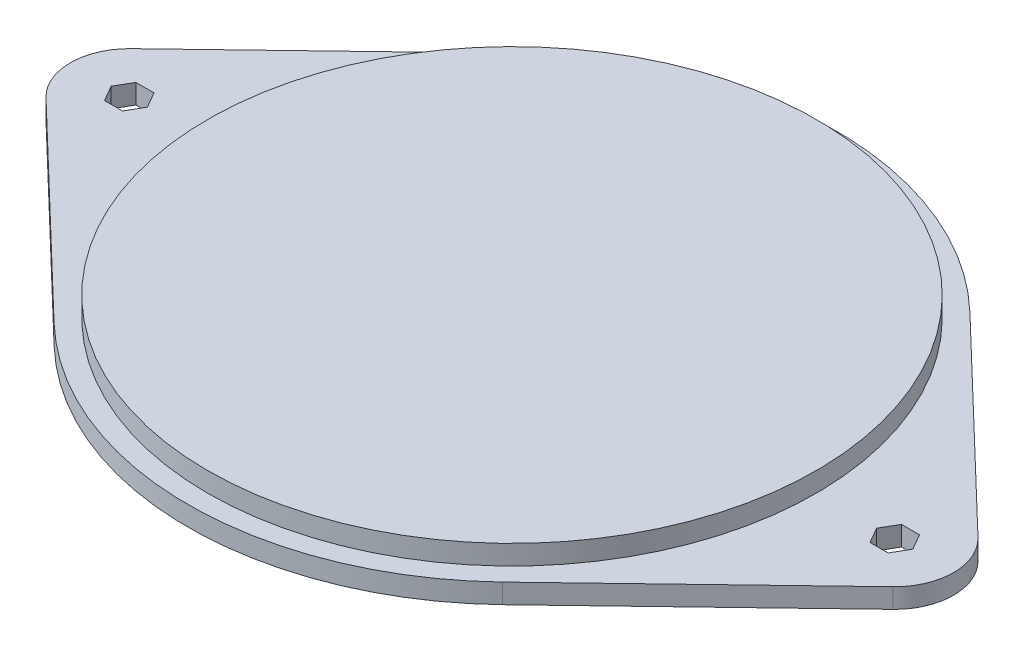
ISO-10303-21;
HEADER;
FILE_DESCRIPTION(('STEP AP214'),'2;1');
FILE_NAME('part.step','',(''),(''),'','','');
FILE_SCHEMA(('AUTOMOTIVE_DESIGN { 1 0 10303 214 1 1 1 1 }'));
ENDSEC;
DATA;
#1=APPLICATION_CONTEXT('core data for automotive mechanical design processes');
#2=APPLICATION_PROTOCOL_DEFINITION('international standard','automotive_design',2000,#1);
#3=PRODUCT_CONTEXT('',#1,'mechanical');
#4=PRODUCT('Part','Part','',(#3));
#5=PRODUCT_RELATED_PRODUCT_CATEGORY('part','',(#4));
#6=PRODUCT_DEFINITION_FORMATION('','',#4);
#7=PRODUCT_DEFINITION_CONTEXT('part definition',#1,'design');
#8=PRODUCT_DEFINITION('design','',#6,#7);
#9=PRODUCT_DEFINITION_SHAPE('','',#8);
#10=(LENGTH_UNIT() NAMED_UNIT(*) SI_UNIT(.MILLI.,.METRE.));
#11=(NAMED_UNIT(*) PLANE_ANGLE_UNIT() SI_UNIT($,.RADIAN.));
#12=(NAMED_UNIT(*) SI_UNIT($,.STERADIAN.) SOLID_ANGLE_UNIT());
#13=UNCERTAINTY_MEASURE_WITH_UNIT(LENGTH_MEASURE(1.E-05),#10,'distance_accuracy_value','');
#14=(GEOMETRIC_REPRESENTATION_CONTEXT(3) GLOBAL_UNCERTAINTY_ASSIGNED_CONTEXT((#13)) GLOBAL_UNIT_ASSIGNED_CONTEXT((#10,
#11,#12)) REPRESENTATION_CONTEXT('',''));
#15=CARTESIAN_POINT('',(0.,0.,0.));
#16=DIRECTION('',(0.,0.,1.));
#17=DIRECTION('',(1.,0.,0.));
#18=AXIS2_PLACEMENT_3D('',#15,#16,#17);
#19=CARTESIAN_POINT('',(-97.5,5.,0.));
#20=DIRECTION('',(0.,-1.,0.));
#21=DIRECTION('',(0.,0.,-1.));
#22=AXIS2_PLACEMENT_3D('',#19,#20,#21);
#23=CYLINDRICAL_SURFACE('',#22,15.);
#24=CARTESIAN_POINT('',(-97.5,0.,0.));
#25=DIRECTION('',(0.,1.,0.));
#26=DIRECTION('',(0.,0.,1.));
#27=AXIS2_PLACEMENT_3D('',#24,#25,#26);
#28=CIRCLE('',#27,15.);
#29=CARTESIAN_POINT('',(-107.884615384615,0.,10.8240363688233));
#30=VERTEX_POINT('',#29);
#31=CARTESIAN_POINT('',(-107.884615384615,0.,-10.8240363688233));
#32=VERTEX_POINT('',#31);
#33=EDGE_CURVE('E322',#30,#32,#28,.F.);
#34=ORIENTED_EDGE('',*,*,#33,.F.);
#35=DIRECTION('',(0.,-1.,0.));
#36=VECTOR('',#35,1.);
#37=CARTESIAN_POINT('',(-107.884615384615,5.,10.8240363688233));
#38=LINE('',#37,#36);
#39=CARTESIAN_POINT('',(-107.884615384615,5.,10.8240363688233));
#40=VERTEX_POINT('',#39);
#41=EDGE_CURVE('E331',#40,#30,#38,.T.);
#42=ORIENTED_EDGE('',*,*,#41,.F.);
#43=CARTESIAN_POINT('',(-97.5,5.,0.));
#44=DIRECTION('',(0.,1.,0.));
#45=DIRECTION('',(0.,0.,1.));
#46=AXIS2_PLACEMENT_3D('',#43,#44,#45);
#47=CIRCLE('',#46,15.);
#48=CARTESIAN_POINT('',(-107.884615384615,5.,-10.8240363688233));
#49=VERTEX_POINT('',#48);
#50=EDGE_CURVE('E311',#40,#49,#47,.F.);
#51=ORIENTED_EDGE('',*,*,#50,.T.);
#52=DIRECTION('',(0.,-1.,0.));
#53=VECTOR('',#52,1.);
#54=CARTESIAN_POINT('',(-107.884615384615,5.,-10.8240363688233));
#55=LINE('',#54,#53);
#56=EDGE_CURVE('E73',#49,#32,#55,.T.);
#57=ORIENTED_EDGE('',*,*,#56,.T.);
#58=EDGE_LOOP('',(#34,#42,#51,#57));
#59=FACE_BOUND('',#58,.T.);
#60=ADVANCED_FACE('F64',(#59),#23,.T.);
#61=CARTESIAN_POINT('',(-57.1153846153846,5.,59.5322000285281));
#62=DIRECTION('',(0.692307692307693,0.,-0.72160242458822));
#63=DIRECTION('',(-0.72160242458822,0.,-0.692307692307693));
#64=AXIS2_PLACEMENT_3D('',#61,#62,#63);
#65=PLANE('',#64);
#66=DIRECTION('',(0.72160242458822,0.,0.692307692307693));
#67=VECTOR('',#66,1.);
#68=CARTESIAN_POINT('',(-57.1153846153846,0.,59.5322000285281));
#69=LINE('',#68,#67);
#70=CARTESIAN_POINT('',(-57.1153846153846,0.,59.5322000285281));
#71=VERTEX_POINT('',#70);
#72=EDGE_CURVE('E312',#30,#71,#69,.T.);
#73=ORIENTED_EDGE('',*,*,#72,.T.);
#74=DIRECTION('',(0.,-1.,0.));
#75=VECTOR('',#74,1.);
#76=CARTESIAN_POINT('',(-57.1153846153846,5.,59.5322000285281));
#77=LINE('',#76,#75);
#78=CARTESIAN_POINT('',(-57.1153846153846,5.,59.5322000285281));
#79=VERTEX_POINT('',#78);
#80=EDGE_CURVE('E329',#79,#71,#77,.T.);
#81=ORIENTED_EDGE('',*,*,#80,.F.);
#82=DIRECTION('',(0.72160242458822,0.,0.692307692307693));
#83=VECTOR('',#82,1.);
#84=CARTESIAN_POINT('',(-57.1153846153846,5.,59.5322000285281));
#85=LINE('',#84,#83);
#86=EDGE_CURVE('E315',#40,#79,#85,.T.);
#87=ORIENTED_EDGE('',*,*,#86,.F.);
#88=ORIENTED_EDGE('',*,*,#41,.T.);
#89=EDGE_LOOP('',(#73,#81,#87,#88));
#90=FACE_BOUND('',#89,.T.);
#91=ADVANCED_FACE('F405',(#90),#65,.F.);
#92=CARTESIAN_POINT('',(-57.1153846153846,5.,-59.5322000285282));
#93=DIRECTION('',(0.692307692307692,0.,0.72160242458822));
#94=DIRECTION('',(0.72160242458822,0.,-0.692307692307692));
#95=AXIS2_PLACEMENT_3D('',#92,#93,#94);
#96=PLANE('',#95);
#97=DIRECTION('',(-0.72160242458822,0.,0.692307692307692));
#98=VECTOR('',#97,1.);
#99=CARTESIAN_POINT('',(-57.1153846153846,0.,-59.5322000285282));
#100=LINE('',#99,#98);
#101=CARTESIAN_POINT('',(-57.1153846153846,0.,-59.5322000285282));
#102=VERTEX_POINT('',#101);
#103=EDGE_CURVE('E319',#102,#32,#100,.T.);
#104=ORIENTED_EDGE('',*,*,#103,.T.);
#105=ORIENTED_EDGE('',*,*,#56,.F.);
#106=DIRECTION('',(-0.72160242458822,0.,0.692307692307692));
#107=VECTOR('',#106,1.);
#108=CARTESIAN_POINT('',(-57.1153846153846,5.,-59.5322000285282));
#109=LINE('',#108,#107);
#110=CARTESIAN_POINT('',(-57.1153846153846,5.,-59.5322000285282));
#111=VERTEX_POINT('',#110);
#112=EDGE_CURVE('E309',#111,#49,#109,.T.);
#113=ORIENTED_EDGE('',*,*,#112,.F.);
#114=DIRECTION('',(0.,-1.,0.));
#115=VECTOR('',#114,1.);
#116=CARTESIAN_POINT('',(-57.1153846153846,5.,-59.5322000285282));
#117=LINE('',#116,#115);
#118=EDGE_CURVE('E318',#111,#102,#117,.T.);
#119=ORIENTED_EDGE('',*,*,#118,.T.);
#120=EDGE_LOOP('',(#104,#105,#113,#119));
#121=FACE_BOUND('',#120,.T.);
#122=ADVANCED_FACE('F398',(#121),#96,.F.);
#123=CARTESIAN_POINT('',(0.,0.,0.));
#124=DIRECTION('',(0.,1.,0.));
#125=DIRECTION('',(0.,0.,1.));
#126=AXIS2_PLACEMENT_3D('',#123,#124,#125);
#127=PLANE('',#126);
#128=DIRECTION('',(0.500000000000001,0.,-0.866025403784438));
#129=VECTOR('',#128,1.);
#130=CARTESIAN_POINT('',(99.8094010767585,0.,3.99999999999996));
#131=LINE('',#130,#129);
#132=CARTESIAN_POINT('',(99.8094010767585,0.,3.99999999999996));
#133=VERTEX_POINT('',#132);
#134=CARTESIAN_POINT('',(102.118802153517,0.,0.));
#135=VERTEX_POINT('',#134);
#136=EDGE_CURVE('E215',#133,#135,#131,.T.);
#137=ORIENTED_EDGE('',*,*,#136,.T.);
#138=DIRECTION('',(-0.500000000000001,0.,-0.866025403784438));
#139=VECTOR('',#138,1.);
#140=CARTESIAN_POINT('',(102.118802153517,0.,0.));
#141=LINE('',#140,#139);
#142=CARTESIAN_POINT('',(99.8094010767585,0.,-4.));
#143=VERTEX_POINT('',#142);
#144=EDGE_CURVE('E207',#135,#143,#141,.T.);
#145=ORIENTED_EDGE('',*,*,#144,.T.);
#146=DIRECTION('',(-1.,0.,0.));
#147=VECTOR('',#146,1.);
#148=CARTESIAN_POINT('',(99.8094010767585,0.,-4.));
#149=LINE('',#148,#147);
#150=CARTESIAN_POINT('',(95.1905989232415,0.,-4.));
#151=VERTEX_POINT('',#150);
#152=EDGE_CURVE('E218',#143,#151,#149,.T.);
#153=ORIENTED_EDGE('',*,*,#152,.T.);
#154=DIRECTION('',(-0.500000000000001,0.,0.866025403784438));
#155=VECTOR('',#154,1.);
#156=CARTESIAN_POINT('',(95.1905989232415,0.,-4.));
#157=LINE('',#156,#155);
#158=CARTESIAN_POINT('',(92.881197846483,0.,0.));
#159=VERTEX_POINT('',#158);
#160=EDGE_CURVE('E81',#151,#159,#157,.T.);
#161=ORIENTED_EDGE('',*,*,#160,.T.);
#162=DIRECTION('',(0.500000000000002,0.,0.866025403784438));
#163=VECTOR('',#162,1.);
#164=CARTESIAN_POINT('',(92.881197846483,0.,0.));
#165=LINE('',#164,#163);
#166=CARTESIAN_POINT('',(95.1905989232415,0.,3.99999999999996));
#167=VERTEX_POINT('',#166);
#168=EDGE_CURVE('E233',#159,#167,#165,.T.);
#169=ORIENTED_EDGE('',*,*,#168,.T.);
#170=DIRECTION('',(1.,0.,0.));
#171=VECTOR('',#170,1.);
#172=CARTESIAN_POINT('',(95.1905989232415,0.,3.99999999999996));
#173=LINE('',#172,#171);
#174=EDGE_CURVE('E236',#167,#133,#173,.T.);
#175=ORIENTED_EDGE('',*,*,#174,.T.);
#176=EDGE_LOOP('',(#137,#145,#153,#161,#169,#175));
#177=FACE_BOUND('',#176,.T.);
#178=DIRECTION('',(0.500000000000001,0.,-0.866025403784438));
#179=VECTOR('',#178,1.);
#180=CARTESIAN_POINT('',(-95.1905989232415,0.,4.00000000000004));
#181=LINE('',#180,#179);
#182=CARTESIAN_POINT('',(-95.1905989232415,0.,4.00000000000004));
#183=VERTEX_POINT('',#182);
#184=CARTESIAN_POINT('',(-92.881197846483,0.,0.));
#185=VERTEX_POINT('',#184);
#186=EDGE_CURVE('E275',#183,#185,#181,.T.);
#187=ORIENTED_EDGE('',*,*,#186,.T.);
#188=DIRECTION('',(-0.5,0.,-0.866025403784438));
#189=VECTOR('',#188,1.);
#190=CARTESIAN_POINT('',(-92.881197846483,0.,0.));
#191=LINE('',#190,#189);
#192=CARTESIAN_POINT('',(-95.1905989232415,0.,-4.));
#193=VERTEX_POINT('',#192);
#194=EDGE_CURVE('E261',#185,#193,#191,.T.);
#195=ORIENTED_EDGE('',*,*,#194,.T.);
#196=DIRECTION('',(-1.,0.,0.));
#197=VECTOR('',#196,1.);
#198=CARTESIAN_POINT('',(-95.1905989232415,0.,-4.));
#199=LINE('',#198,#197);
#200=CARTESIAN_POINT('',(-99.8094010767585,0.,-4.));
#201=VERTEX_POINT('',#200);
#202=EDGE_CURVE('E264',#193,#201,#199,.T.);
#203=ORIENTED_EDGE('',*,*,#202,.T.);
#204=DIRECTION('',(-0.499999999999999,0.,0.866025403784439));
#205=VECTOR('',#204,1.);
#206=CARTESIAN_POINT('',(-99.8094010767585,0.,-4.));
#207=LINE('',#206,#205);
#208=CARTESIAN_POINT('',(-102.118802153517,0.,0.));
#209=VERTEX_POINT('',#208);
#210=EDGE_CURVE('E89',#201,#209,#207,.T.);
#211=ORIENTED_EDGE('',*,*,#210,.T.);
#212=DIRECTION('',(0.5,0.,0.866025403784439));
#213=VECTOR('',#212,1.);
#214=CARTESIAN_POINT('',(-102.118802153517,0.,0.));
#215=LINE('',#214,#213);
#216=CARTESIAN_POINT('',(-99.8094010767585,0.,4.00000000000004));
#217=VERTEX_POINT('',#216);
#218=EDGE_CURVE('E269',#209,#217,#215,.T.);
#219=ORIENTED_EDGE('',*,*,#218,.T.);
#220=DIRECTION('',(1.,0.,0.));
#221=VECTOR('',#220,1.);
#222=CARTESIAN_POINT('',(-99.8094010767585,0.,4.00000000000004));
#223=LINE('',#222,#221);
#224=EDGE_CURVE('E272',#217,#183,#223,.T.);
#225=ORIENTED_EDGE('',*,*,#224,.T.);
#226=EDGE_LOOP('',(#187,#195,#203,#211,#219,#225));
#227=FACE_BOUND('',#226,.T.);
#228=ORIENTED_EDGE('',*,*,#103,.F.);
#229=CARTESIAN_POINT('',(0.,0.,0.));
#230=DIRECTION('',(0.,1.,0.));
#231=DIRECTION('',(0.,0.,1.));
#232=AXIS2_PLACEMENT_3D('',#229,#230,#231);
#233=CIRCLE('',#232,82.5);
#234=CARTESIAN_POINT('',(57.1153846153846,0.,-59.5322000285282));
#235=VERTEX_POINT('',#234);
#236=EDGE_CURVE('E68',#235,#102,#233,.T.);
#237=ORIENTED_EDGE('',*,*,#236,.F.);
#238=DIRECTION('',(0.72160242458822,0.,0.692307692307692));
#239=VECTOR('',#238,1.);
#240=CARTESIAN_POINT('',(57.1153846153846,0.,-59.5322000285282));
#241=LINE('',#240,#239);
#242=CARTESIAN_POINT('',(107.884615384615,0.,-10.8240363688233));
#243=VERTEX_POINT('',#242);
#244=EDGE_CURVE('E338',#235,#243,#241,.T.);
#245=ORIENTED_EDGE('',*,*,#244,.T.);
#246=CARTESIAN_POINT('',(97.5,0.,0.));
#247=DIRECTION('',(0.,1.,0.));
#248=DIRECTION('',(0.,0.,1.));
#249=AXIS2_PLACEMENT_3D('',#246,#247,#248);
#250=CIRCLE('',#249,15.);
#251=CARTESIAN_POINT('',(107.884615384615,0.,10.8240363688233));
#252=VERTEX_POINT('',#251);
#253=EDGE_CURVE('E347',#252,#243,#250,.T.);
#254=ORIENTED_EDGE('',*,*,#253,.F.);
#255=DIRECTION('',(-0.72160242458822,0.,0.692307692307693));
#256=VECTOR('',#255,1.);
#257=CARTESIAN_POINT('',(57.1153846153846,0.,59.5322000285281));
#258=LINE('',#257,#256);
#259=CARTESIAN_POINT('',(57.1153846153846,0.,59.5322000285281));
#260=VERTEX_POINT('',#259);
#261=EDGE_CURVE('E344',#252,#260,#258,.T.);
#262=ORIENTED_EDGE('',*,*,#261,.T.);
#263=EDGE_CURVE('E307',#71,#260,#233,.T.);
#264=ORIENTED_EDGE('',*,*,#263,.F.);
#265=ORIENTED_EDGE('',*,*,#72,.F.);
#266=ORIENTED_EDGE('',*,*,#33,.T.);
#267=EDGE_LOOP('',(#228,#237,#245,#254,#262,#264,#265,#266));
#268=FACE_BOUND('',#267,.T.);
#269=ADVANCED_FACE('F222',(#177,#227,#268),#127,.F.);
#270=CARTESIAN_POINT('',(0.,5.,0.));
#271=DIRECTION('',(0.,1.,0.));
#272=DIRECTION('',(0.,0.,1.));
#273=AXIS2_PLACEMENT_3D('',#270,#271,#272);
#274=PLANE('',#273);
#275=DIRECTION('',(-0.500000000000001,0.,-0.866025403784438));
#276=VECTOR('',#275,1.);
#277=CARTESIAN_POINT('',(102.118802153517,5.,0.));
#278=LINE('',#277,#276);
#279=CARTESIAN_POINT('',(102.118802153517,5.,0.));
#280=VERTEX_POINT('',#279);
#281=CARTESIAN_POINT('',(99.8094010767585,5.,-4.));
#282=VERTEX_POINT('',#281);
#283=EDGE_CURVE('E210',#280,#282,#278,.T.);
#284=ORIENTED_EDGE('',*,*,#283,.F.);
#285=DIRECTION('',(0.500000000000001,0.,-0.866025403784438));
#286=VECTOR('',#285,1.);
#287=CARTESIAN_POINT('',(99.8094010767585,5.,3.99999999999996));
#288=LINE('',#287,#286);
#289=CARTESIAN_POINT('',(99.8094010767585,5.,3.99999999999996));
#290=VERTEX_POINT('',#289);
#291=EDGE_CURVE('E226',#290,#280,#288,.T.);
#292=ORIENTED_EDGE('',*,*,#291,.F.);
#293=DIRECTION('',(1.,0.,0.));
#294=VECTOR('',#293,1.);
#295=CARTESIAN_POINT('',(95.1905989232415,5.,3.99999999999996));
#296=LINE('',#295,#294);
#297=CARTESIAN_POINT('',(95.1905989232415,5.,3.99999999999996));
#298=VERTEX_POINT('',#297);
#299=EDGE_CURVE('E229',#298,#290,#296,.T.);
#300=ORIENTED_EDGE('',*,*,#299,.F.);
#301=DIRECTION('',(0.500000000000002,0.,0.866025403784438));
#302=VECTOR('',#301,1.);
#303=CARTESIAN_POINT('',(92.881197846483,5.,0.));
#304=LINE('',#303,#302);
#305=CARTESIAN_POINT('',(92.881197846483,5.,0.));
#306=VERTEX_POINT('',#305);
#307=EDGE_CURVE('E246',#306,#298,#304,.T.);
#308=ORIENTED_EDGE('',*,*,#307,.F.);
#309=DIRECTION('',(-0.500000000000001,0.,0.866025403784438));
#310=VECTOR('',#309,1.);
#311=CARTESIAN_POINT('',(95.1905989232415,5.,-4.));
#312=LINE('',#311,#310);
#313=CARTESIAN_POINT('',(95.1905989232415,5.,-4.));
#314=VERTEX_POINT('',#313);
#315=EDGE_CURVE('E243',#314,#306,#312,.T.);
#316=ORIENTED_EDGE('',*,*,#315,.F.);
#317=DIRECTION('',(-1.,0.,0.));
#318=VECTOR('',#317,1.);
#319=CARTESIAN_POINT('',(99.8094010767585,5.,-4.));
#320=LINE('',#319,#318);
#321=EDGE_CURVE('E240',#282,#314,#320,.T.);
#322=ORIENTED_EDGE('',*,*,#321,.F.);
#323=EDGE_LOOP('',(#284,#292,#300,#308,#316,#322));
#324=FACE_BOUND('',#323,.T.);
#325=DIRECTION('',(-0.5,0.,-0.866025403784438));
#326=VECTOR('',#325,1.);
#327=CARTESIAN_POINT('',(-92.881197846483,5.,0.));
#328=LINE('',#327,#326);
#329=CARTESIAN_POINT('',(-92.881197846483,5.,0.));
#330=VERTEX_POINT('',#329);
#331=CARTESIAN_POINT('',(-95.1905989232415,5.,-4.));
#332=VERTEX_POINT('',#331);
#333=EDGE_CURVE('E279',#330,#332,#328,.T.);
#334=ORIENTED_EDGE('',*,*,#333,.F.);
#335=DIRECTION('',(0.500000000000001,0.,-0.866025403784438));
#336=VECTOR('',#335,1.);
#337=CARTESIAN_POINT('',(-95.1905989232415,5.,4.00000000000004));
#338=LINE('',#337,#336);
#339=CARTESIAN_POINT('',(-95.1905989232415,5.,4.00000000000004));
#340=VERTEX_POINT('',#339);
#341=EDGE_CURVE('E265',#340,#330,#338,.T.);
#342=ORIENTED_EDGE('',*,*,#341,.F.);
#343=DIRECTION('',(1.,0.,0.));
#344=VECTOR('',#343,1.);
#345=CARTESIAN_POINT('',(-99.8094010767585,5.,4.00000000000004));
#346=LINE('',#345,#344);
#347=CARTESIAN_POINT('',(-99.8094010767585,5.,4.00000000000004));
#348=VERTEX_POINT('',#347);
#349=EDGE_CURVE('E290',#348,#340,#346,.T.);
#350=ORIENTED_EDGE('',*,*,#349,.F.);
#351=DIRECTION('',(0.5,0.,0.866025403784439));
#352=VECTOR('',#351,1.);
#353=CARTESIAN_POINT('',(-102.118802153517,5.,0.));
#354=LINE('',#353,#352);
#355=CARTESIAN_POINT('',(-102.118802153517,5.,0.));
#356=VERTEX_POINT('',#355);
#357=EDGE_CURVE('E287',#356,#348,#354,.T.);
#358=ORIENTED_EDGE('',*,*,#357,.F.);
#359=DIRECTION('',(-0.499999999999999,0.,0.866025403784439));
#360=VECTOR('',#359,1.);
#361=CARTESIAN_POINT('',(-99.8094010767585,5.,-4.));
#362=LINE('',#361,#360);
#363=CARTESIAN_POINT('',(-99.8094010767585,5.,-4.));
#364=VERTEX_POINT('',#363);
#365=EDGE_CURVE('E284',#364,#356,#362,.T.);
#366=ORIENTED_EDGE('',*,*,#365,.F.);
#367=DIRECTION('',(-1.,0.,0.));
#368=VECTOR('',#367,1.);
#369=CARTESIAN_POINT('',(-95.1905989232415,5.,-4.));
#370=LINE('',#369,#368);
#371=EDGE_CURVE('E281',#332,#364,#370,.T.);
#372=ORIENTED_EDGE('',*,*,#371,.F.);
#373=EDGE_LOOP('',(#334,#342,#350,#358,#366,#372));
#374=FACE_BOUND('',#373,.T.);
#375=CARTESIAN_POINT('',(0.,5.,0.));
#376=DIRECTION('',(0.,1.,0.));
#377=DIRECTION('',(0.,0.,1.));
#378=AXIS2_PLACEMENT_3D('',#375,#376,#377);
#379=CIRCLE('',#378,77.5);
#380=CARTESIAN_POINT('',(0.,5.,77.5));
#381=VERTEX_POINT('',#380);
#382=EDGE_CURVE('E12',#381,#381,#379,.T.);
#383=ORIENTED_EDGE('',*,*,#382,.F.);
#384=EDGE_LOOP('',(#383));
#385=FACE_BOUND('',#384,.T.);
#386=ORIENTED_EDGE('',*,*,#112,.T.);
#387=ORIENTED_EDGE('',*,*,#50,.F.);
#388=ORIENTED_EDGE('',*,*,#86,.T.);
#389=CARTESIAN_POINT('',(0.,5.,0.));
#390=DIRECTION('',(0.,1.,0.));
#391=DIRECTION('',(0.,0.,1.));
#392=AXIS2_PLACEMENT_3D('',#389,#390,#391);
#393=CIRCLE('',#392,82.5);
#394=CARTESIAN_POINT('',(57.1153846153846,5.,59.5322000285281));
#395=VERTEX_POINT('',#394);
#396=EDGE_CURVE('E360',#79,#395,#393,.T.);
#397=ORIENTED_EDGE('',*,*,#396,.T.);
#398=DIRECTION('',(-0.72160242458822,0.,0.692307692307693));
#399=VECTOR('',#398,1.);
#400=CARTESIAN_POINT('',(57.1153846153846,5.,59.5322000285281));
#401=LINE('',#400,#399);
#402=CARTESIAN_POINT('',(107.884615384615,5.,10.8240363688233));
#403=VERTEX_POINT('',#402);
#404=EDGE_CURVE('E334',#403,#395,#401,.T.);
#405=ORIENTED_EDGE('',*,*,#404,.F.);
#406=CARTESIAN_POINT('',(97.5,5.,0.));
#407=DIRECTION('',(0.,1.,0.));
#408=DIRECTION('',(0.,0.,1.));
#409=AXIS2_PLACEMENT_3D('',#406,#407,#408);
#410=CIRCLE('',#409,15.);
#411=CARTESIAN_POINT('',(107.884615384615,5.,-10.8240363688233));
#412=VERTEX_POINT('',#411);
#413=EDGE_CURVE('E337',#403,#412,#410,.T.);
#414=ORIENTED_EDGE('',*,*,#413,.T.);
#415=DIRECTION('',(0.72160242458822,0.,0.692307692307692));
#416=VECTOR('',#415,1.);
#417=CARTESIAN_POINT('',(57.1153846153846,5.,-59.5322000285282));
#418=LINE('',#417,#416);
#419=CARTESIAN_POINT('',(57.1153846153846,5.,-59.5322000285282));
#420=VERTEX_POINT('',#419);
#421=EDGE_CURVE('E340',#420,#412,#418,.T.);
#422=ORIENTED_EDGE('',*,*,#421,.F.);
#423=EDGE_CURVE('E348',#420,#111,#393,.T.);
#424=ORIENTED_EDGE('',*,*,#423,.T.);
#425=EDGE_LOOP('',(#386,#387,#388,#397,#405,#414,#422,#424));
#426=FACE_BOUND('',#425,.T.);
#427=ADVANCED_FACE('F386',(#324,#374,#385,#426),#274,.T.);
#428=CARTESIAN_POINT('',(97.5,5.,0.));
#429=DIRECTION('',(0.,-1.,0.));
#430=DIRECTION('',(0.,0.,-1.));
#431=AXIS2_PLACEMENT_3D('',#428,#429,#430);
#432=CYLINDRICAL_SURFACE('',#431,15.);
#433=ORIENTED_EDGE('',*,*,#253,.T.);
#434=DIRECTION('',(0.,-1.,0.));
#435=VECTOR('',#434,1.);
#436=CARTESIAN_POINT('',(107.884615384615,5.,-10.8240363688233));
#437=LINE('',#436,#435);
#438=EDGE_CURVE('E354',#412,#243,#437,.T.);
#439=ORIENTED_EDGE('',*,*,#438,.F.);
#440=ORIENTED_EDGE('',*,*,#413,.F.);
#441=DIRECTION('',(0.,-1.,0.));
#442=VECTOR('',#441,1.);
#443=CARTESIAN_POINT('',(107.884615384615,5.,10.8240363688233));
#444=LINE('',#443,#442);
#445=EDGE_CURVE('E356',#403,#252,#444,.T.);
#446=ORIENTED_EDGE('',*,*,#445,.T.);
#447=EDGE_LOOP('',(#433,#439,#440,#446));
#448=FACE_BOUND('',#447,.T.);
#449=ADVANCED_FACE('F384',(#448),#432,.T.);
#450=CARTESIAN_POINT('',(57.1153846153846,5.,-59.5322000285282));
#451=DIRECTION('',(0.692307692307692,0.,-0.72160242458822));
#452=DIRECTION('',(-0.72160242458822,0.,-0.692307692307692));
#453=AXIS2_PLACEMENT_3D('',#450,#451,#452);
#454=PLANE('',#453);
#455=ORIENTED_EDGE('',*,*,#244,.F.);
#456=DIRECTION('',(0.,-1.,0.));
#457=VECTOR('',#456,1.);
#458=CARTESIAN_POINT('',(57.1153846153846,5.,-59.5322000285282));
#459=LINE('',#458,#457);
#460=EDGE_CURVE('E343',#420,#235,#459,.T.);
#461=ORIENTED_EDGE('',*,*,#460,.F.);
#462=ORIENTED_EDGE('',*,*,#421,.T.);
#463=ORIENTED_EDGE('',*,*,#438,.T.);
#464=EDGE_LOOP('',(#455,#461,#462,#463));
#465=FACE_BOUND('',#464,.T.);
#466=ADVANCED_FACE('F396',(#465),#454,.T.);
#467=CARTESIAN_POINT('',(57.1153846153846,5.,59.5322000285281));
#468=DIRECTION('',(0.692307692307693,0.,0.72160242458822));
#469=DIRECTION('',(0.72160242458822,0.,-0.692307692307693));
#470=AXIS2_PLACEMENT_3D('',#467,#468,#469);
#471=PLANE('',#470);
#472=ORIENTED_EDGE('',*,*,#261,.F.);
#473=ORIENTED_EDGE('',*,*,#445,.F.);
#474=ORIENTED_EDGE('',*,*,#404,.T.);
#475=DIRECTION('',(0.,-1.,0.));
#476=VECTOR('',#475,1.);
#477=CARTESIAN_POINT('',(57.1153846153846,5.,59.5322000285281));
#478=LINE('',#477,#476);
#479=EDGE_CURVE('E323',#395,#260,#478,.T.);
#480=ORIENTED_EDGE('',*,*,#479,.T.);
#481=EDGE_LOOP('',(#472,#473,#474,#480));
#482=FACE_BOUND('',#481,.T.);
#483=ADVANCED_FACE('F379',(#482),#471,.T.);
#484=CARTESIAN_POINT('',(0.,5.,0.));
#485=DIRECTION('',(0.,-1.,0.));
#486=DIRECTION('',(0.,0.,-1.));
#487=AXIS2_PLACEMENT_3D('',#484,#485,#486);
#488=CYLINDRICAL_SURFACE('',#487,82.5);
#489=ORIENTED_EDGE('',*,*,#118,.F.);
#490=ORIENTED_EDGE('',*,*,#423,.F.);
#491=ORIENTED_EDGE('',*,*,#460,.T.);
#492=ORIENTED_EDGE('',*,*,#236,.T.);
#493=EDGE_LOOP('',(#489,#490,#491,#492));
#494=FACE_BOUND('',#493,.T.);
#495=ADVANCED_FACE('F66',(#494),#488,.T.);
#496=ORIENTED_EDGE('',*,*,#396,.F.);
#497=ORIENTED_EDGE('',*,*,#80,.T.);
#498=ORIENTED_EDGE('',*,*,#263,.T.);
#499=ORIENTED_EDGE('',*,*,#479,.F.);
#500=EDGE_LOOP('',(#496,#497,#498,#499));
#501=FACE_BOUND('',#500,.T.);
#502=ADVANCED_FACE('F374',(#501),#488,.T.);
#503=CARTESIAN_POINT('',(0.,10.,0.));
#504=DIRECTION('',(0.,-1.,0.));
#505=DIRECTION('',(0.,0.,-1.));
#506=AXIS2_PLACEMENT_3D('',#503,#504,#505);
#507=CYLINDRICAL_SURFACE('',#506,77.5);
#508=CARTESIAN_POINT('',(0.,10.,0.));
#509=DIRECTION('',(0.,1.,0.));
#510=DIRECTION('',(0.,0.,1.));
#511=AXIS2_PLACEMENT_3D('',#508,#509,#510);
#512=CIRCLE('',#511,77.5);
#513=CARTESIAN_POINT('',(0.,10.,77.5));
#514=VERTEX_POINT('',#513);
#515=EDGE_CURVE('E253',#514,#514,#512,.T.);
#516=ORIENTED_EDGE('',*,*,#515,.F.);
#517=EDGE_LOOP('',(#516));
#518=FACE_BOUND('',#517,.T.);
#519=ORIENTED_EDGE('',*,*,#382,.T.);
#520=EDGE_LOOP('',(#519));
#521=FACE_BOUND('',#520,.T.);
#522=ADVANCED_FACE('F403',(#518,#521),#507,.T.);
#523=CARTESIAN_POINT('',(0.,10.,0.));
#524=DIRECTION('',(0.,1.,0.));
#525=DIRECTION('',(0.,0.,1.));
#526=AXIS2_PLACEMENT_3D('',#523,#524,#525);
#527=PLANE('',#526);
#528=ORIENTED_EDGE('',*,*,#515,.T.);
#529=EDGE_LOOP('',(#528));
#530=FACE_BOUND('',#529,.T.);
#531=ADVANCED_FACE('F427',(#530),#527,.T.);
#532=CARTESIAN_POINT('',(-92.881197846483,0.,0.));
#533=DIRECTION('',(0.866025403784438,0.,-0.5));
#534=DIRECTION('',(-0.5,0.,-0.866025403784438));
#535=AXIS2_PLACEMENT_3D('',#532,#533,#534);
#536=PLANE('',#535);
#537=ORIENTED_EDGE('',*,*,#333,.T.);
#538=DIRECTION('',(0.,1.,0.));
#539=VECTOR('',#538,1.);
#540=CARTESIAN_POINT('',(-95.1905989232415,0.,-4.));
#541=LINE('',#540,#539);
#542=EDGE_CURVE('E278',#193,#332,#541,.T.);
#543=ORIENTED_EDGE('',*,*,#542,.F.);
#544=ORIENTED_EDGE('',*,*,#194,.F.);
#545=DIRECTION('',(0.,1.,0.));
#546=VECTOR('',#545,1.);
#547=CARTESIAN_POINT('',(-92.881197846483,0.,0.));
#548=LINE('',#547,#546);
#549=EDGE_CURVE('E241',#185,#330,#548,.T.);
#550=ORIENTED_EDGE('',*,*,#549,.T.);
#551=EDGE_LOOP('',(#537,#543,#544,#550));
#552=FACE_BOUND('',#551,.T.);
#553=ADVANCED_FACE('F432',(#552),#536,.F.);
#554=CARTESIAN_POINT('',(-95.1905989232415,0.,4.00000000000004));
#555=DIRECTION('',(0.866025403784438,0.,0.500000000000001));
#556=DIRECTION('',(0.500000000000001,0.,-0.866025403784438));
#557=AXIS2_PLACEMENT_3D('',#554,#555,#556);
#558=PLANE('',#557);
#559=ORIENTED_EDGE('',*,*,#341,.T.);
#560=ORIENTED_EDGE('',*,*,#549,.F.);
#561=ORIENTED_EDGE('',*,*,#186,.F.);
#562=DIRECTION('',(0.,1.,0.));
#563=VECTOR('',#562,1.);
#564=CARTESIAN_POINT('',(-95.1905989232415,0.,4.00000000000004));
#565=LINE('',#564,#563);
#566=EDGE_CURVE('E296',#183,#340,#565,.T.);
#567=ORIENTED_EDGE('',*,*,#566,.T.);
#568=EDGE_LOOP('',(#559,#560,#561,#567));
#569=FACE_BOUND('',#568,.T.);
#570=ADVANCED_FACE('F440',(#569),#558,.F.);
#571=CARTESIAN_POINT('',(-99.8094010767585,0.,4.00000000000004));
#572=DIRECTION('',(0.,0.,1.));
#573=DIRECTION('',(1.,0.,0.));
#574=AXIS2_PLACEMENT_3D('',#571,#572,#573);
#575=PLANE('',#574);
#576=ORIENTED_EDGE('',*,*,#349,.T.);
#577=ORIENTED_EDGE('',*,*,#566,.F.);
#578=ORIENTED_EDGE('',*,*,#224,.F.);
#579=DIRECTION('',(0.,1.,0.));
#580=VECTOR('',#579,1.);
#581=CARTESIAN_POINT('',(-99.8094010767585,0.,4.00000000000004));
#582=LINE('',#581,#580);
#583=EDGE_CURVE('E298',#217,#348,#582,.T.);
#584=ORIENTED_EDGE('',*,*,#583,.T.);
#585=EDGE_LOOP('',(#576,#577,#578,#584));
#586=FACE_BOUND('',#585,.T.);
#587=ADVANCED_FACE('F452',(#586),#575,.F.);
#588=CARTESIAN_POINT('',(-102.118802153517,0.,0.));
#589=DIRECTION('',(-0.866025403784439,0.,0.5));
#590=DIRECTION('',(0.5,0.,0.866025403784439));
#591=AXIS2_PLACEMENT_3D('',#588,#589,#590);
#592=PLANE('',#591);
#593=ORIENTED_EDGE('',*,*,#357,.T.);
#594=ORIENTED_EDGE('',*,*,#583,.F.);
#595=ORIENTED_EDGE('',*,*,#218,.F.);
#596=DIRECTION('',(0.,1.,0.));
#597=VECTOR('',#596,1.);
#598=CARTESIAN_POINT('',(-102.118802153517,0.,0.));
#599=LINE('',#598,#597);
#600=EDGE_CURVE('E300',#209,#356,#599,.T.);
#601=ORIENTED_EDGE('',*,*,#600,.T.);
#602=EDGE_LOOP('',(#593,#594,#595,#601));
#603=FACE_BOUND('',#602,.T.);
#604=ADVANCED_FACE('F449',(#603),#592,.F.);
#605=CARTESIAN_POINT('',(-99.8094010767585,0.,-4.));
#606=DIRECTION('',(-0.866025403784439,0.,-0.499999999999999));
#607=DIRECTION('',(-0.499999999999999,0.,0.866025403784439));
#608=AXIS2_PLACEMENT_3D('',#605,#606,#607);
#609=PLANE('',#608);
#610=ORIENTED_EDGE('',*,*,#365,.T.);
#611=ORIENTED_EDGE('',*,*,#600,.F.);
#612=ORIENTED_EDGE('',*,*,#210,.F.);
#613=DIRECTION('',(0.,1.,0.));
#614=VECTOR('',#613,1.);
#615=CARTESIAN_POINT('',(-99.8094010767585,0.,-4.));
#616=LINE('',#615,#614);
#617=EDGE_CURVE('E302',#201,#364,#616,.T.);
#618=ORIENTED_EDGE('',*,*,#617,.T.);
#619=EDGE_LOOP('',(#610,#611,#612,#618));
#620=FACE_BOUND('',#619,.T.);
#621=ADVANCED_FACE('F445',(#620),#609,.F.);
#622=CARTESIAN_POINT('',(-95.1905989232415,0.,-4.));
#623=DIRECTION('',(0.,0.,-1.));
#624=DIRECTION('',(-1.,0.,0.));
#625=AXIS2_PLACEMENT_3D('',#622,#623,#624);
#626=PLANE('',#625);
#627=ORIENTED_EDGE('',*,*,#371,.T.);
#628=ORIENTED_EDGE('',*,*,#617,.F.);
#629=ORIENTED_EDGE('',*,*,#202,.F.);
#630=ORIENTED_EDGE('',*,*,#542,.T.);
#631=EDGE_LOOP('',(#627,#628,#629,#630));
#632=FACE_BOUND('',#631,.T.);
#633=ADVANCED_FACE('F442',(#632),#626,.F.);
#634=CARTESIAN_POINT('',(102.118802153517,0.,0.));
#635=DIRECTION('',(0.866025403784438,0.,-0.500000000000001));
#636=DIRECTION('',(-0.500000000000001,0.,-0.866025403784438));
#637=AXIS2_PLACEMENT_3D('',#634,#635,#636);
#638=PLANE('',#637);
#639=ORIENTED_EDGE('',*,*,#283,.T.);
#640=DIRECTION('',(0.,1.,0.));
#641=VECTOR('',#640,1.);
#642=CARTESIAN_POINT('',(99.8094010767585,0.,-4.));
#643=LINE('',#642,#641);
#644=EDGE_CURVE('E203',#143,#282,#643,.T.);
#645=ORIENTED_EDGE('',*,*,#644,.F.);
#646=ORIENTED_EDGE('',*,*,#144,.F.);
#647=DIRECTION('',(0.,1.,0.));
#648=VECTOR('',#647,1.);
#649=CARTESIAN_POINT('',(102.118802153517,0.,0.));
#650=LINE('',#649,#648);
#651=EDGE_CURVE('E251',#135,#280,#650,.T.);
#652=ORIENTED_EDGE('',*,*,#651,.T.);
#653=EDGE_LOOP('',(#639,#645,#646,#652));
#654=FACE_BOUND('',#653,.T.);
#655=ADVANCED_FACE('F205',(#654),#638,.F.);
#656=CARTESIAN_POINT('',(99.8094010767585,0.,3.99999999999996));
#657=DIRECTION('',(0.866025403784438,0.,0.500000000000001));
#658=DIRECTION('',(0.500000000000001,0.,-0.866025403784438));
#659=AXIS2_PLACEMENT_3D('',#656,#657,#658);
#660=PLANE('',#659);
#661=ORIENTED_EDGE('',*,*,#291,.T.);
#662=ORIENTED_EDGE('',*,*,#651,.F.);
#663=ORIENTED_EDGE('',*,*,#136,.F.);
#664=DIRECTION('',(0.,1.,0.));
#665=VECTOR('',#664,1.);
#666=CARTESIAN_POINT('',(99.8094010767585,0.,3.99999999999996));
#667=LINE('',#666,#665);
#668=EDGE_CURVE('E254',#133,#290,#667,.T.);
#669=ORIENTED_EDGE('',*,*,#668,.T.);
#670=EDGE_LOOP('',(#661,#662,#663,#669));
#671=FACE_BOUND('',#670,.T.);
#672=ADVANCED_FACE('F462',(#671),#660,.F.);
#673=CARTESIAN_POINT('',(95.1905989232415,0.,3.99999999999996));
#674=DIRECTION('',(0.,0.,1.));
#675=DIRECTION('',(1.,0.,0.));
#676=AXIS2_PLACEMENT_3D('',#673,#674,#675);
#677=PLANE('',#676);
#678=ORIENTED_EDGE('',*,*,#299,.T.);
#679=ORIENTED_EDGE('',*,*,#668,.F.);
#680=ORIENTED_EDGE('',*,*,#174,.F.);
#681=DIRECTION('',(0.,1.,0.));
#682=VECTOR('',#681,1.);
#683=CARTESIAN_POINT('',(95.1905989232415,0.,3.99999999999996));
#684=LINE('',#683,#682);
#685=EDGE_CURVE('E256',#167,#298,#684,.T.);
#686=ORIENTED_EDGE('',*,*,#685,.T.);
#687=EDGE_LOOP('',(#678,#679,#680,#686));
#688=FACE_BOUND('',#687,.T.);
#689=ADVANCED_FACE('F471',(#688),#677,.F.);
#690=CARTESIAN_POINT('',(92.881197846483,0.,0.));
#691=DIRECTION('',(-0.866025403784438,0.,0.500000000000002));
#692=DIRECTION('',(0.500000000000002,0.,0.866025403784438));
#693=AXIS2_PLACEMENT_3D('',#690,#691,#692);
#694=PLANE('',#693);
#695=ORIENTED_EDGE('',*,*,#307,.T.);
#696=ORIENTED_EDGE('',*,*,#685,.F.);
#697=ORIENTED_EDGE('',*,*,#168,.F.);
#698=DIRECTION('',(0.,1.,0.));
#699=VECTOR('',#698,1.);
#700=CARTESIAN_POINT('',(92.881197846483,0.,0.));
#701=LINE('',#700,#699);
#702=EDGE_CURVE('E258',#159,#306,#701,.T.);
#703=ORIENTED_EDGE('',*,*,#702,.T.);
#704=EDGE_LOOP('',(#695,#696,#697,#703));
#705=FACE_BOUND('',#704,.T.);
#706=ADVANCED_FACE('F468',(#705),#694,.F.);
#707=CARTESIAN_POINT('',(95.1905989232415,0.,-4.));
#708=DIRECTION('',(-0.866025403784438,0.,-0.500000000000001));
#709=DIRECTION('',(-0.500000000000001,0.,0.866025403784438));
#710=AXIS2_PLACEMENT_3D('',#707,#708,#709);
#711=PLANE('',#710);
#712=ORIENTED_EDGE('',*,*,#315,.T.);
#713=ORIENTED_EDGE('',*,*,#702,.F.);
#714=ORIENTED_EDGE('',*,*,#160,.F.);
#715=DIRECTION('',(0.,1.,0.));
#716=VECTOR('',#715,1.);
#717=CARTESIAN_POINT('',(95.1905989232415,0.,-4.));
#718=LINE('',#717,#716);
#719=EDGE_CURVE('E214',#151,#314,#718,.T.);
#720=ORIENTED_EDGE('',*,*,#719,.T.);
#721=EDGE_LOOP('',(#712,#713,#714,#720));
#722=FACE_BOUND('',#721,.T.);
#723=ADVANCED_FACE('F465',(#722),#711,.F.);
#724=CARTESIAN_POINT('',(99.8094010767585,0.,-4.));
#725=DIRECTION('',(0.,0.,-1.));
#726=DIRECTION('',(-1.,0.,0.));
#727=AXIS2_PLACEMENT_3D('',#724,#725,#726);
#728=PLANE('',#727);
#729=ORIENTED_EDGE('',*,*,#321,.T.);
#730=ORIENTED_EDGE('',*,*,#719,.F.);
#731=ORIENTED_EDGE('',*,*,#152,.F.);
#732=ORIENTED_EDGE('',*,*,#644,.T.);
#733=EDGE_LOOP('',(#729,#730,#731,#732));
#734=FACE_BOUND('',#733,.T.);
#735=ADVANCED_FACE('F219',(#734),#728,.F.);
#736=CLOSED_SHELL('',(#60,#91,#122,#269,#427,#449,#466,#483,#495,#502,#522,#531,#553,#570,#587,
#604,#621,#633,#655,#672,#689,#706,#723,#735));
#737=MANIFOLD_SOLID_BREP('B2',#736);
#738=ADVANCED_BREP_SHAPE_REPRESENTATION('',(#18,#737),#14);
#739=SHAPE_DEFINITION_REPRESENTATION(#9,#738);
ENDSEC;
END-ISO-10303-21;
